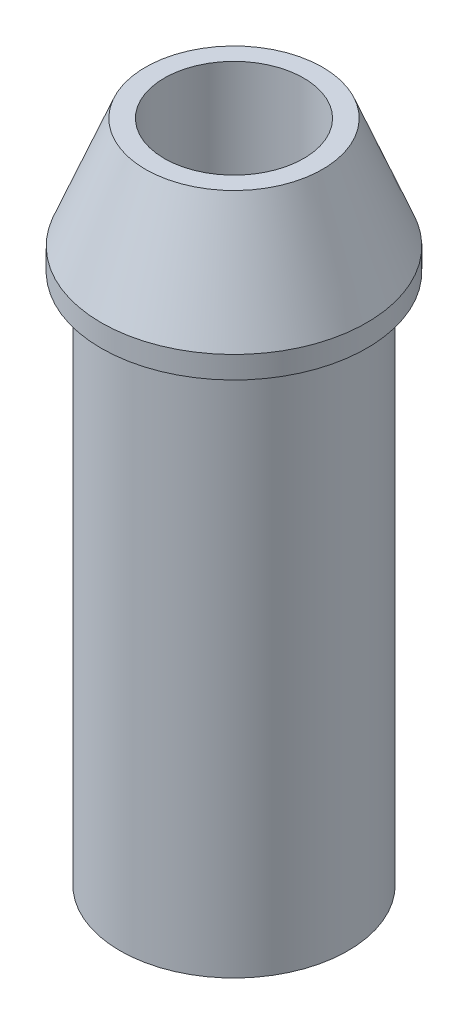
ISO-10303-21;
HEADER;
FILE_DESCRIPTION(('STEP AP214'),'2;1');
FILE_NAME('part.step','',(''),(''),'','','');
FILE_SCHEMA(('AUTOMOTIVE_DESIGN { 1 0 10303 214 1 1 1 1 }'));
ENDSEC;
DATA;
#1=APPLICATION_CONTEXT('core data for automotive mechanical design processes');
#2=APPLICATION_PROTOCOL_DEFINITION('international standard','automotive_design',2000,#1);
#3=PRODUCT_CONTEXT('',#1,'mechanical');
#4=PRODUCT('Part','Part','',(#3));
#5=PRODUCT_RELATED_PRODUCT_CATEGORY('part','',(#4));
#6=PRODUCT_DEFINITION_FORMATION('','',#4);
#7=PRODUCT_DEFINITION_CONTEXT('part definition',#1,'design');
#8=PRODUCT_DEFINITION('design','',#6,#7);
#9=PRODUCT_DEFINITION_SHAPE('','',#8);
#10=(LENGTH_UNIT() NAMED_UNIT(*) SI_UNIT(.MILLI.,.METRE.));
#11=(NAMED_UNIT(*) PLANE_ANGLE_UNIT() SI_UNIT($,.RADIAN.));
#12=(NAMED_UNIT(*) SI_UNIT($,.STERADIAN.) SOLID_ANGLE_UNIT());
#13=UNCERTAINTY_MEASURE_WITH_UNIT(LENGTH_MEASURE(1.E-05),#10,'distance_accuracy_value','');
#14=(GEOMETRIC_REPRESENTATION_CONTEXT(3) GLOBAL_UNCERTAINTY_ASSIGNED_CONTEXT((#13)) GLOBAL_UNIT_ASSIGNED_CONTEXT((#10,
#11,#12)) REPRESENTATION_CONTEXT('',''));
#15=CARTESIAN_POINT('',(0.,0.,0.));
#16=DIRECTION('',(0.,0.,1.));
#17=DIRECTION('',(1.,0.,0.));
#18=AXIS2_PLACEMENT_3D('',#15,#16,#17);
#19=CARTESIAN_POINT('',(0.,15.,0.));
#20=DIRECTION('',(0.,-1.,0.));
#21=DIRECTION('',(0.,0.,-1.));
#22=AXIS2_PLACEMENT_3D('',#19,#20,#21);
#23=CYLINDRICAL_SURFACE('',#22,2.575);
#24=CARTESIAN_POINT('',(0.,0.,0.));
#25=DIRECTION('',(0.,1.,0.));
#26=DIRECTION('',(0.,0.,1.));
#27=AXIS2_PLACEMENT_3D('',#24,#25,#26);
#28=CIRCLE('',#27,2.575);
#29=CARTESIAN_POINT('',(0.,0.,2.575));
#30=VERTEX_POINT('',#29);
#31=EDGE_CURVE('E54',#30,#30,#28,.T.);
#32=ORIENTED_EDGE('',*,*,#31,.T.);
#33=EDGE_LOOP('',(#32));
#34=FACE_BOUND('',#33,.T.);
#35=CARTESIAN_POINT('',(0.,12.,0.));
#36=DIRECTION('',(0.,1.,0.));
#37=DIRECTION('',(0.,0.,1.));
#38=AXIS2_PLACEMENT_3D('',#35,#36,#37);
#39=CIRCLE('',#38,2.575);
#40=CARTESIAN_POINT('',(0.,12.,2.575));
#41=VERTEX_POINT('',#40);
#42=EDGE_CURVE('E50',#41,#41,#39,.T.);
#43=ORIENTED_EDGE('',*,*,#42,.F.);
#44=EDGE_LOOP('',(#43));
#45=FACE_BOUND('',#44,.T.);
#46=ADVANCED_FACE('F38',(#34,#45),#23,.T.);
#47=CARTESIAN_POINT('',(0.,15.,0.));
#48=DIRECTION('',(0.,1.,0.));
#49=DIRECTION('',(0.,0.,1.));
#50=AXIS2_PLACEMENT_3D('',#47,#48,#49);
#51=PLANE('',#50);
#52=CARTESIAN_POINT('',(0.,15.,0.));
#53=DIRECTION('',(0.,1.,0.));
#54=DIRECTION('',(0.,0.,1.));
#55=AXIS2_PLACEMENT_3D('',#52,#53,#54);
#56=CIRCLE('',#55,2.);
#57=CARTESIAN_POINT('',(0.,15.,2.));
#58=VERTEX_POINT('',#57);
#59=EDGE_CURVE('E46',#58,#58,#56,.T.);
#60=ORIENTED_EDGE('',*,*,#59,.T.);
#61=EDGE_LOOP('',(#60));
#62=FACE_BOUND('',#61,.T.);
#63=CARTESIAN_POINT('',(0.,15.,0.));
#64=DIRECTION('',(0.,1.,0.));
#65=DIRECTION('',(0.,0.,1.));
#66=AXIS2_PLACEMENT_3D('',#63,#64,#65);
#67=CIRCLE('',#66,1.575);
#68=CARTESIAN_POINT('',(0.,15.,1.575));
#69=VERTEX_POINT('',#68);
#70=EDGE_CURVE('E59',#69,#69,#67,.T.);
#71=ORIENTED_EDGE('',*,*,#70,.F.);
#72=EDGE_LOOP('',(#71));
#73=FACE_BOUND('',#72,.T.);
#74=ADVANCED_FACE('F79',(#62,#73),#51,.T.);
#75=CARTESIAN_POINT('',(0.,0.,0.));
#76=DIRECTION('',(0.,1.,0.));
#77=DIRECTION('',(0.,0.,1.));
#78=AXIS2_PLACEMENT_3D('',#75,#76,#77);
#79=PLANE('',#78);
#80=ORIENTED_EDGE('',*,*,#31,.F.);
#81=EDGE_LOOP('',(#80));
#82=FACE_BOUND('',#81,.T.);
#83=CARTESIAN_POINT('',(0.,0.,0.));
#84=DIRECTION('',(0.,1.,0.));
#85=DIRECTION('',(0.,0.,1.));
#86=AXIS2_PLACEMENT_3D('',#83,#84,#85);
#87=CIRCLE('',#86,1.575);
#88=CARTESIAN_POINT('',(0.,0.,1.575));
#89=VERTEX_POINT('',#88);
#90=EDGE_CURVE('E60',#89,#89,#87,.T.);
#91=ORIENTED_EDGE('',*,*,#90,.T.);
#92=EDGE_LOOP('',(#91));
#93=FACE_BOUND('',#92,.T.);
#94=ADVANCED_FACE('F84',(#82,#93),#79,.F.);
#95=CARTESIAN_POINT('',(0.,15.,0.));
#96=DIRECTION('',(0.,-1.,0.));
#97=DIRECTION('',(0.,0.,-1.));
#98=AXIS2_PLACEMENT_3D('',#95,#96,#97);
#99=CYLINDRICAL_SURFACE('',#98,1.575);
#100=ORIENTED_EDGE('',*,*,#70,.T.);
#101=EDGE_LOOP('',(#100));
#102=FACE_BOUND('',#101,.T.);
#103=ORIENTED_EDGE('',*,*,#90,.F.);
#104=EDGE_LOOP('',(#103));
#105=FACE_BOUND('',#104,.T.);
#106=ADVANCED_FACE('F74',(#102,#105),#99,.F.);
#107=CARTESIAN_POINT('',(0.,12.,0.));
#108=DIRECTION('',(0.,1.,0.));
#109=DIRECTION('',(0.,0.,1.));
#110=AXIS2_PLACEMENT_3D('',#107,#108,#109);
#111=PLANE('',#110);
#112=CARTESIAN_POINT('',(0.,12.,0.));
#113=DIRECTION('',(0.,1.,0.));
#114=DIRECTION('',(0.,0.,1.));
#115=AXIS2_PLACEMENT_3D('',#112,#113,#114);
#116=CIRCLE('',#115,3.);
#117=CARTESIAN_POINT('',(0.,12.,3.));
#118=VERTEX_POINT('',#117);
#119=EDGE_CURVE('E63',#118,#118,#116,.T.);
#120=ORIENTED_EDGE('',*,*,#119,.F.);
#121=EDGE_LOOP('',(#120));
#122=FACE_BOUND('',#121,.T.);
#123=ORIENTED_EDGE('',*,*,#42,.T.);
#124=EDGE_LOOP('',(#123));
#125=FACE_BOUND('',#124,.T.);
#126=ADVANCED_FACE('F71',(#122,#125),#111,.F.);
#127=CARTESIAN_POINT('',(0.,12.,0.));
#128=DIRECTION('',(0.,1.,0.));
#129=DIRECTION('',(0.,0.,1.));
#130=AXIS2_PLACEMENT_3D('',#127,#128,#129);
#131=CYLINDRICAL_SURFACE('',#130,3.);
#132=CARTESIAN_POINT('',(0.,12.5,0.));
#133=DIRECTION('',(0.,1.,0.));
#134=DIRECTION('',(0.,0.,1.));
#135=AXIS2_PLACEMENT_3D('',#132,#133,#134);
#136=CIRCLE('',#135,3.);
#137=CARTESIAN_POINT('',(0.,12.5,3.));
#138=VERTEX_POINT('',#137);
#139=EDGE_CURVE('E10',#138,#138,#136,.F.);
#140=ORIENTED_EDGE('',*,*,#139,.T.);
#141=EDGE_LOOP('',(#140));
#142=FACE_BOUND('',#141,.T.);
#143=ORIENTED_EDGE('',*,*,#119,.T.);
#144=EDGE_LOOP('',(#143));
#145=FACE_BOUND('',#144,.T.);
#146=ADVANCED_FACE('F69',(#142,#145),#131,.T.);
#147=CARTESIAN_POINT('',(0.,15.,0.));
#148=DIRECTION('',(0.,-1.,0.));
#149=DIRECTION('',(0.,0.,-1.));
#150=AXIS2_PLACEMENT_3D('',#147,#148,#149);
#151=CONICAL_SURFACE('',#150,2.,0.380506377112363);
#152=ORIENTED_EDGE('',*,*,#139,.F.);
#153=EDGE_LOOP('',(#152));
#154=FACE_BOUND('',#153,.T.);
#155=ORIENTED_EDGE('',*,*,#59,.F.);
#156=EDGE_LOOP('',(#155));
#157=FACE_BOUND('',#156,.T.);
#158=ADVANCED_FACE('F41',(#154,#157),#151,.T.);
#159=CLOSED_SHELL('',(#46,#74,#94,#106,#126,#146,#158));
#160=MANIFOLD_SOLID_BREP('B2',#159);
#161=ADVANCED_BREP_SHAPE_REPRESENTATION('',(#18,#160),#14);
#162=SHAPE_DEFINITION_REPRESENTATION(#9,#161);
ENDSEC;
END-ISO-10303-21;
